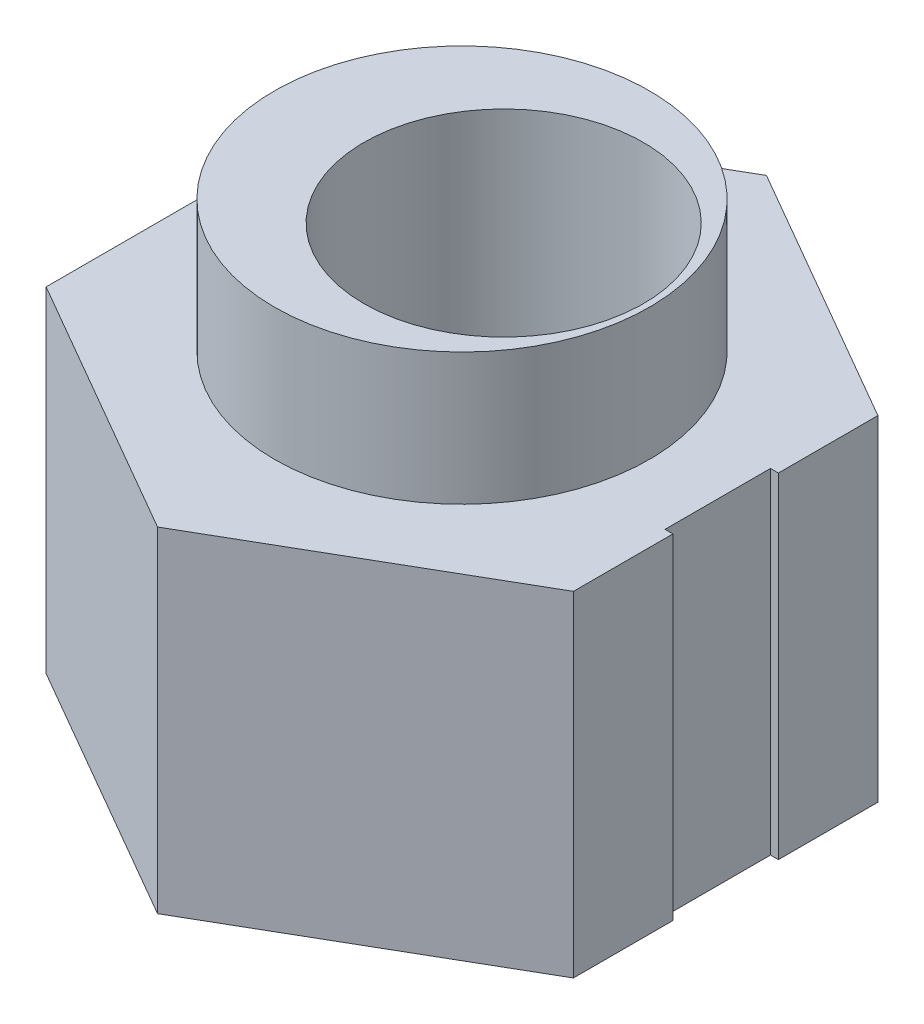
ISO-10303-21;
HEADER;
FILE_DESCRIPTION(('STEP AP214'),'2;1');
FILE_NAME('part.step','',(''),(''),'','','');
FILE_SCHEMA(('AUTOMOTIVE_DESIGN { 1 0 10303 214 1 1 1 1 }'));
ENDSEC;
DATA;
#1=APPLICATION_CONTEXT('core data for automotive mechanical design processes');
#2=APPLICATION_PROTOCOL_DEFINITION('international standard','automotive_design',2000,#1);
#3=PRODUCT_CONTEXT('',#1,'mechanical');
#4=PRODUCT('Part','Part','',(#3));
#5=PRODUCT_RELATED_PRODUCT_CATEGORY('part','',(#4));
#6=PRODUCT_DEFINITION_FORMATION('','',#4);
#7=PRODUCT_DEFINITION_CONTEXT('part definition',#1,'design');
#8=PRODUCT_DEFINITION('design','',#6,#7);
#9=PRODUCT_DEFINITION_SHAPE('','',#8);
#10=(LENGTH_UNIT() NAMED_UNIT(*) SI_UNIT(.MILLI.,.METRE.));
#11=(NAMED_UNIT(*) PLANE_ANGLE_UNIT() SI_UNIT($,.RADIAN.));
#12=(NAMED_UNIT(*) SI_UNIT($,.STERADIAN.) SOLID_ANGLE_UNIT());
#13=UNCERTAINTY_MEASURE_WITH_UNIT(LENGTH_MEASURE(1.E-05),#10,'distance_accuracy_value','');
#14=(GEOMETRIC_REPRESENTATION_CONTEXT(3) GLOBAL_UNCERTAINTY_ASSIGNED_CONTEXT((#13)) GLOBAL_UNIT_ASSIGNED_CONTEXT((#10,
#11,#12)) REPRESENTATION_CONTEXT('',''));
#15=CARTESIAN_POINT('',(0.,0.,0.));
#16=DIRECTION('',(0.,0.,1.));
#17=DIRECTION('',(1.,0.,0.));
#18=AXIS2_PLACEMENT_3D('',#15,#16,#17);
#19=CARTESIAN_POINT('',(0.,6.35,0.));
#20=DIRECTION('',(0.,1.,0.));
#21=DIRECTION('',(0.,0.,1.));
#22=AXIS2_PLACEMENT_3D('',#19,#20,#21);
#23=PLANE('',#22);
#24=DIRECTION('',(0.,0.,-1.));
#25=VECTOR('',#24,1.);
#26=CARTESIAN_POINT('',(4.06,6.35,0.));
#27=LINE('',#26,#25);
#28=CARTESIAN_POINT('',(4.06,6.35,1.));
#29=VERTEX_POINT('',#28);
#30=CARTESIAN_POINT('',(4.06,6.35,-1.));
#31=VERTEX_POINT('',#30);
#32=EDGE_CURVE('E147',#29,#31,#27,.T.);
#33=ORIENTED_EDGE('',*,*,#32,.T.);
#34=DIRECTION('',(1.,0.,0.));
#35=VECTOR('',#34,1.);
#36=CARTESIAN_POINT('',(0.,6.35,-1.));
#37=LINE('',#36,#35);
#38=CARTESIAN_POINT('',(4.21,6.35,-1.));
#39=VERTEX_POINT('',#38);
#40=EDGE_CURVE('E94',#31,#39,#37,.T.);
#41=ORIENTED_EDGE('',*,*,#40,.T.);
#42=DIRECTION('',(0.,0.,-1.));
#43=VECTOR('',#42,1.);
#44=CARTESIAN_POINT('',(4.21,6.35,0.));
#45=LINE('',#44,#43);
#46=CARTESIAN_POINT('',(4.21,6.35,-2.88675134594813));
#47=VERTEX_POINT('',#46);
#48=EDGE_CURVE('E139',#39,#47,#45,.T.);
#49=ORIENTED_EDGE('',*,*,#48,.T.);
#50=DIRECTION('',(-0.866025403784439,0.,-0.5));
#51=VECTOR('',#50,1.);
#52=CARTESIAN_POINT('',(2.3025,6.35,-3.98804698442734));
#53=LINE('',#52,#51);
#54=CARTESIAN_POINT('',(-0.789999999999999,6.35,-5.77350269189626));
#55=VERTEX_POINT('',#54);
#56=EDGE_CURVE('E143',#47,#55,#53,.T.);
#57=ORIENTED_EDGE('',*,*,#56,.T.);
#58=DIRECTION('',(-0.866025403784439,0.,0.5));
#59=VECTOR('',#58,1.);
#60=CARTESIAN_POINT('',(-2.6975,6.35,-4.67220705341705));
#61=LINE('',#60,#59);
#62=CARTESIAN_POINT('',(-5.79,6.35,-2.88675134594813));
#63=VERTEX_POINT('',#62);
#64=EDGE_CURVE('E146',#55,#63,#61,.T.);
#65=ORIENTED_EDGE('',*,*,#64,.T.);
#66=DIRECTION('',(0.,0.,1.));
#67=VECTOR('',#66,1.);
#68=CARTESIAN_POINT('',(-5.79,6.35,0.));
#69=LINE('',#68,#67);
#70=CARTESIAN_POINT('',(-5.79,6.35,2.88675134594813));
#71=VERTEX_POINT('',#70);
#72=EDGE_CURVE('E256',#63,#71,#69,.T.);
#73=ORIENTED_EDGE('',*,*,#72,.T.);
#74=DIRECTION('',(0.866025403784439,0.,0.5));
#75=VECTOR('',#74,1.);
#76=CARTESIAN_POINT('',(-2.6975,6.35,4.67220705341705));
#77=LINE('',#76,#75);
#78=CARTESIAN_POINT('',(-0.79,6.35,5.77350269189626));
#79=VERTEX_POINT('',#78);
#80=EDGE_CURVE('E122',#71,#79,#77,.T.);
#81=ORIENTED_EDGE('',*,*,#80,.T.);
#82=DIRECTION('',(0.866025403784439,0.,-0.5));
#83=VECTOR('',#82,1.);
#84=CARTESIAN_POINT('',(2.3025,6.35,3.98804698442734));
#85=LINE('',#84,#83);
#86=CARTESIAN_POINT('',(4.21,6.35,2.88675134594813));
#87=VERTEX_POINT('',#86);
#88=EDGE_CURVE('E115',#79,#87,#85,.T.);
#89=ORIENTED_EDGE('',*,*,#88,.T.);
#90=CARTESIAN_POINT('',(4.21,6.35,1.));
#91=VERTEX_POINT('',#90);
#92=EDGE_CURVE('E120',#87,#91,#45,.T.);
#93=ORIENTED_EDGE('',*,*,#92,.T.);
#94=DIRECTION('',(1.,0.,0.));
#95=VECTOR('',#94,1.);
#96=CARTESIAN_POINT('',(0.,6.35,1.));
#97=LINE('',#96,#95);
#98=EDGE_CURVE('E137',#29,#91,#97,.T.);
#99=ORIENTED_EDGE('',*,*,#98,.F.);
#100=EDGE_LOOP('',(#33,#41,#49,#57,#65,#73,#81,#89,#93,#99));
#101=FACE_BOUND('',#100,.T.);
#102=CARTESIAN_POINT('',(-0.79,6.35,0.));
#103=DIRECTION('',(0.,1.,0.));
#104=DIRECTION('',(0.,0.,1.));
#105=AXIS2_PLACEMENT_3D('',#102,#103,#104);
#106=CIRCLE('',#105,3.555);
#107=CARTESIAN_POINT('',(-0.79,6.35,3.555));
#108=VERTEX_POINT('',#107);
#109=EDGE_CURVE('E151',#108,#108,#106,.T.);
#110=ORIENTED_EDGE('',*,*,#109,.F.);
#111=EDGE_LOOP('',(#110));
#112=FACE_BOUND('',#111,.T.);
#113=ADVANCED_FACE('F32',(#101,#112),#23,.T.);
#114=CARTESIAN_POINT('',(4.06,6.35,0.));
#115=DIRECTION('',(-1.,0.,0.));
#116=DIRECTION('',(0.,0.,1.));
#117=AXIS2_PLACEMENT_3D('',#114,#115,#116);
#118=PLANE('',#117);
#119=DIRECTION('',(0.,0.,-1.));
#120=VECTOR('',#119,1.);
#121=CARTESIAN_POINT('',(4.06,0.,0.));
#122=LINE('',#121,#120);
#123=CARTESIAN_POINT('',(4.06,0.,1.));
#124=VERTEX_POINT('',#123);
#125=CARTESIAN_POINT('',(4.06,0.,-1.));
#126=VERTEX_POINT('',#125);
#127=EDGE_CURVE('E220',#124,#126,#122,.T.);
#128=ORIENTED_EDGE('',*,*,#127,.T.);
#129=DIRECTION('',(0.,-1.,0.));
#130=VECTOR('',#129,1.);
#131=CARTESIAN_POINT('',(4.06,6.35,-1.));
#132=LINE('',#131,#130);
#133=EDGE_CURVE('E11',#31,#126,#132,.T.);
#134=ORIENTED_EDGE('',*,*,#133,.F.);
#135=ORIENTED_EDGE('',*,*,#32,.F.);
#136=DIRECTION('',(0.,-1.,0.));
#137=VECTOR('',#136,1.);
#138=CARTESIAN_POINT('',(4.06,6.35,1.));
#139=LINE('',#138,#137);
#140=EDGE_CURVE('E49',#29,#124,#139,.T.);
#141=ORIENTED_EDGE('',*,*,#140,.T.);
#142=EDGE_LOOP('',(#128,#134,#135,#141));
#143=FACE_BOUND('',#142,.T.);
#144=ADVANCED_FACE('F179',(#143),#118,.F.);
#145=CARTESIAN_POINT('',(0.,6.35,-1.));
#146=DIRECTION('',(0.,0.,-1.));
#147=DIRECTION('',(-1.,0.,0.));
#148=AXIS2_PLACEMENT_3D('',#145,#146,#147);
#149=PLANE('',#148);
#150=DIRECTION('',(1.,0.,0.));
#151=VECTOR('',#150,1.);
#152=CARTESIAN_POINT('',(0.,0.,-1.));
#153=LINE('',#152,#151);
#154=CARTESIAN_POINT('',(4.21,0.,-1.));
#155=VERTEX_POINT('',#154);
#156=EDGE_CURVE('E214',#126,#155,#153,.T.);
#157=ORIENTED_EDGE('',*,*,#156,.T.);
#158=DIRECTION('',(0.,-1.,0.));
#159=VECTOR('',#158,1.);
#160=CARTESIAN_POINT('',(4.21,6.35,-1.));
#161=LINE('',#160,#159);
#162=EDGE_CURVE('E41',#39,#155,#161,.T.);
#163=ORIENTED_EDGE('',*,*,#162,.F.);
#164=ORIENTED_EDGE('',*,*,#40,.F.);
#165=ORIENTED_EDGE('',*,*,#133,.T.);
#166=EDGE_LOOP('',(#157,#163,#164,#165));
#167=FACE_BOUND('',#166,.T.);
#168=ADVANCED_FACE('F184',(#167),#149,.F.);
#169=CARTESIAN_POINT('',(4.21,6.35,0.));
#170=DIRECTION('',(-1.,0.,0.));
#171=DIRECTION('',(0.,0.,1.));
#172=AXIS2_PLACEMENT_3D('',#169,#170,#171);
#173=PLANE('',#172);
#174=DIRECTION('',(0.,0.,-1.));
#175=VECTOR('',#174,1.);
#176=CARTESIAN_POINT('',(4.21,0.,0.));
#177=LINE('',#176,#175);
#178=CARTESIAN_POINT('',(4.21,0.,-2.88675134594813));
#179=VERTEX_POINT('',#178);
#180=EDGE_CURVE('E219',#155,#179,#177,.T.);
#181=ORIENTED_EDGE('',*,*,#180,.T.);
#182=DIRECTION('',(0.,-1.,0.));
#183=VECTOR('',#182,1.);
#184=CARTESIAN_POINT('',(4.21,6.35,-2.88675134594813));
#185=LINE('',#184,#183);
#186=EDGE_CURVE('E223',#47,#179,#185,.T.);
#187=ORIENTED_EDGE('',*,*,#186,.F.);
#188=ORIENTED_EDGE('',*,*,#48,.F.);
#189=ORIENTED_EDGE('',*,*,#162,.T.);
#190=EDGE_LOOP('',(#181,#187,#188,#189));
#191=FACE_BOUND('',#190,.T.);
#192=ADVANCED_FACE('F190',(#191),#173,.F.);
#193=CARTESIAN_POINT('',(2.3025,6.35,-3.98804698442734));
#194=DIRECTION('',(-0.5,0.,0.866025403784439));
#195=DIRECTION('',(0.866025403784439,0.,0.5));
#196=AXIS2_PLACEMENT_3D('',#193,#194,#195);
#197=PLANE('',#196);
#198=DIRECTION('',(-0.866025403784439,0.,-0.5));
#199=VECTOR('',#198,1.);
#200=CARTESIAN_POINT('',(2.3025,0.,-3.98804698442734));
#201=LINE('',#200,#199);
#202=CARTESIAN_POINT('',(-0.789999999999999,0.,-5.77350269189626));
#203=VERTEX_POINT('',#202);
#204=EDGE_CURVE('E226',#179,#203,#201,.T.);
#205=ORIENTED_EDGE('',*,*,#204,.T.);
#206=DIRECTION('',(0.,-1.,0.));
#207=VECTOR('',#206,1.);
#208=CARTESIAN_POINT('',(-0.789999999999999,6.35,-5.77350269189626));
#209=LINE('',#208,#207);
#210=EDGE_CURVE('E248',#55,#203,#209,.T.);
#211=ORIENTED_EDGE('',*,*,#210,.F.);
#212=ORIENTED_EDGE('',*,*,#56,.F.);
#213=ORIENTED_EDGE('',*,*,#186,.T.);
#214=EDGE_LOOP('',(#205,#211,#212,#213));
#215=FACE_BOUND('',#214,.T.);
#216=ADVANCED_FACE('F204',(#215),#197,.F.);
#217=CARTESIAN_POINT('',(-2.6975,6.35,-4.67220705341705));
#218=DIRECTION('',(0.5,0.,0.866025403784439));
#219=DIRECTION('',(0.866025403784439,0.,-0.5));
#220=AXIS2_PLACEMENT_3D('',#217,#218,#219);
#221=PLANE('',#220);
#222=DIRECTION('',(-0.866025403784439,0.,0.5));
#223=VECTOR('',#222,1.);
#224=CARTESIAN_POINT('',(-2.6975,0.,-4.67220705341705));
#225=LINE('',#224,#223);
#226=CARTESIAN_POINT('',(-5.79,0.,-2.88675134594813));
#227=VERTEX_POINT('',#226);
#228=EDGE_CURVE('E229',#203,#227,#225,.T.);
#229=ORIENTED_EDGE('',*,*,#228,.T.);
#230=DIRECTION('',(0.,-1.,0.));
#231=VECTOR('',#230,1.);
#232=CARTESIAN_POINT('',(-5.79,6.35,-2.88675134594813));
#233=LINE('',#232,#231);
#234=EDGE_CURVE('E245',#63,#227,#233,.T.);
#235=ORIENTED_EDGE('',*,*,#234,.F.);
#236=ORIENTED_EDGE('',*,*,#64,.F.);
#237=ORIENTED_EDGE('',*,*,#210,.T.);
#238=EDGE_LOOP('',(#229,#235,#236,#237));
#239=FACE_BOUND('',#238,.T.);
#240=ADVANCED_FACE('F200',(#239),#221,.F.);
#241=CARTESIAN_POINT('',(-5.79,6.35,0.));
#242=DIRECTION('',(1.,0.,0.));
#243=DIRECTION('',(0.,0.,-1.));
#244=AXIS2_PLACEMENT_3D('',#241,#242,#243);
#245=PLANE('',#244);
#246=DIRECTION('',(0.,0.,1.));
#247=VECTOR('',#246,1.);
#248=CARTESIAN_POINT('',(-5.79,0.,0.));
#249=LINE('',#248,#247);
#250=CARTESIAN_POINT('',(-5.79,0.,2.88675134594813));
#251=VERTEX_POINT('',#250);
#252=EDGE_CURVE('E235',#227,#251,#249,.T.);
#253=ORIENTED_EDGE('',*,*,#252,.T.);
#254=DIRECTION('',(0.,-1.,0.));
#255=VECTOR('',#254,1.);
#256=CARTESIAN_POINT('',(-5.79,6.35,2.88675134594813));
#257=LINE('',#256,#255);
#258=EDGE_CURVE('E242',#71,#251,#257,.T.);
#259=ORIENTED_EDGE('',*,*,#258,.F.);
#260=ORIENTED_EDGE('',*,*,#72,.F.);
#261=ORIENTED_EDGE('',*,*,#234,.T.);
#262=EDGE_LOOP('',(#253,#259,#260,#261));
#263=FACE_BOUND('',#262,.T.);
#264=ADVANCED_FACE('F196',(#263),#245,.F.);
#265=CARTESIAN_POINT('',(-2.6975,6.35,4.67220705341705));
#266=DIRECTION('',(0.5,0.,-0.866025403784439));
#267=DIRECTION('',(-0.866025403784439,0.,-0.5));
#268=AXIS2_PLACEMENT_3D('',#265,#266,#267);
#269=PLANE('',#268);
#270=DIRECTION('',(0.866025403784439,0.,0.5));
#271=VECTOR('',#270,1.);
#272=CARTESIAN_POINT('',(-2.6975,0.,4.67220705341705));
#273=LINE('',#272,#271);
#274=CARTESIAN_POINT('',(-0.79,0.,5.77350269189626));
#275=VERTEX_POINT('',#274);
#276=EDGE_CURVE('E233',#251,#275,#273,.T.);
#277=ORIENTED_EDGE('',*,*,#276,.T.);
#278=DIRECTION('',(0.,-1.,0.));
#279=VECTOR('',#278,1.);
#280=CARTESIAN_POINT('',(-0.79,6.35,5.77350269189626));
#281=LINE('',#280,#279);
#282=EDGE_CURVE('E134',#79,#275,#281,.T.);
#283=ORIENTED_EDGE('',*,*,#282,.F.);
#284=ORIENTED_EDGE('',*,*,#80,.F.);
#285=ORIENTED_EDGE('',*,*,#258,.T.);
#286=EDGE_LOOP('',(#277,#283,#284,#285));
#287=FACE_BOUND('',#286,.T.);
#288=ADVANCED_FACE('F193',(#287),#269,.F.);
#289=CARTESIAN_POINT('',(2.3025,6.35,3.98804698442734));
#290=DIRECTION('',(-0.5,0.,-0.866025403784439));
#291=DIRECTION('',(-0.866025403784439,0.,0.5));
#292=AXIS2_PLACEMENT_3D('',#289,#290,#291);
#293=PLANE('',#292);
#294=DIRECTION('',(0.866025403784439,0.,-0.5));
#295=VECTOR('',#294,1.);
#296=CARTESIAN_POINT('',(2.3025,0.,3.98804698442734));
#297=LINE('',#296,#295);
#298=CARTESIAN_POINT('',(4.21,0.,2.88675134594813));
#299=VERTEX_POINT('',#298);
#300=EDGE_CURVE('E131',#275,#299,#297,.T.);
#301=ORIENTED_EDGE('',*,*,#300,.T.);
#302=DIRECTION('',(0.,-1.,0.));
#303=VECTOR('',#302,1.);
#304=CARTESIAN_POINT('',(4.21,6.35,2.88675134594813));
#305=LINE('',#304,#303);
#306=EDGE_CURVE('E128',#87,#299,#305,.T.);
#307=ORIENTED_EDGE('',*,*,#306,.F.);
#308=ORIENTED_EDGE('',*,*,#88,.F.);
#309=ORIENTED_EDGE('',*,*,#282,.T.);
#310=EDGE_LOOP('',(#301,#307,#308,#309));
#311=FACE_BOUND('',#310,.T.);
#312=ADVANCED_FACE('F129',(#311),#293,.F.);
#313=CARTESIAN_POINT('',(4.21,0.,1.));
#314=VERTEX_POINT('',#313);
#315=EDGE_CURVE('E228',#299,#314,#177,.T.);
#316=ORIENTED_EDGE('',*,*,#315,.T.);
#317=DIRECTION('',(0.,-1.,0.));
#318=VECTOR('',#317,1.);
#319=CARTESIAN_POINT('',(4.21,6.35,1.));
#320=LINE('',#319,#318);
#321=EDGE_CURVE('E82',#91,#314,#320,.T.);
#322=ORIENTED_EDGE('',*,*,#321,.F.);
#323=ORIENTED_EDGE('',*,*,#92,.F.);
#324=ORIENTED_EDGE('',*,*,#306,.T.);
#325=EDGE_LOOP('',(#316,#322,#323,#324));
#326=FACE_BOUND('',#325,.T.);
#327=ADVANCED_FACE('F136',(#326),#173,.F.);
#328=CARTESIAN_POINT('',(0.,6.35,0.));
#329=DIRECTION('',(0.,-1.,0.));
#330=DIRECTION('',(0.,0.,-1.));
#331=AXIS2_PLACEMENT_3D('',#328,#329,#330);
#332=CYLINDRICAL_SURFACE('',#331,2.65);
#333=CARTESIAN_POINT('',(0.,0.,0.));
#334=DIRECTION('',(0.,1.,0.));
#335=DIRECTION('',(0.,0.,1.));
#336=AXIS2_PLACEMENT_3D('',#333,#334,#335);
#337=CIRCLE('',#336,2.65);
#338=CARTESIAN_POINT('',(0.,0.,2.65));
#339=VERTEX_POINT('',#338);
#340=EDGE_CURVE('E158',#339,#339,#337,.T.);
#341=ORIENTED_EDGE('',*,*,#340,.F.);
#342=EDGE_LOOP('',(#341));
#343=FACE_BOUND('',#342,.T.);
#344=CARTESIAN_POINT('',(0.,8.85,0.));
#345=DIRECTION('',(0.,1.,0.));
#346=DIRECTION('',(0.,0.,1.));
#347=AXIS2_PLACEMENT_3D('',#344,#345,#346);
#348=CIRCLE('',#347,2.65);
#349=CARTESIAN_POINT('',(0.,8.85,2.65));
#350=VERTEX_POINT('',#349);
#351=EDGE_CURVE('E155',#350,#350,#348,.T.);
#352=ORIENTED_EDGE('',*,*,#351,.T.);
#353=EDGE_LOOP('',(#352));
#354=FACE_BOUND('',#353,.T.);
#355=ADVANCED_FACE('F34',(#343,#354),#332,.F.);
#356=CARTESIAN_POINT('',(0.,6.35,1.));
#357=DIRECTION('',(0.,0.,-1.));
#358=DIRECTION('',(-1.,0.,0.));
#359=AXIS2_PLACEMENT_3D('',#356,#357,#358);
#360=PLANE('',#359);
#361=DIRECTION('',(1.,0.,0.));
#362=VECTOR('',#361,1.);
#363=CARTESIAN_POINT('',(0.,0.,1.));
#364=LINE('',#363,#362);
#365=EDGE_CURVE('E148',#124,#314,#364,.T.);
#366=ORIENTED_EDGE('',*,*,#365,.F.);
#367=ORIENTED_EDGE('',*,*,#140,.F.);
#368=ORIENTED_EDGE('',*,*,#98,.T.);
#369=ORIENTED_EDGE('',*,*,#321,.T.);
#370=EDGE_LOOP('',(#366,#367,#368,#369));
#371=FACE_BOUND('',#370,.T.);
#372=ADVANCED_FACE('F175',(#371),#360,.T.);
#373=CARTESIAN_POINT('',(0.,0.,0.));
#374=DIRECTION('',(0.,1.,0.));
#375=DIRECTION('',(0.,0.,1.));
#376=AXIS2_PLACEMENT_3D('',#373,#374,#375);
#377=PLANE('',#376);
#378=ORIENTED_EDGE('',*,*,#340,.T.);
#379=EDGE_LOOP('',(#378));
#380=FACE_BOUND('',#379,.T.);
#381=ORIENTED_EDGE('',*,*,#127,.F.);
#382=ORIENTED_EDGE('',*,*,#365,.T.);
#383=ORIENTED_EDGE('',*,*,#315,.F.);
#384=ORIENTED_EDGE('',*,*,#300,.F.);
#385=ORIENTED_EDGE('',*,*,#276,.F.);
#386=ORIENTED_EDGE('',*,*,#252,.F.);
#387=ORIENTED_EDGE('',*,*,#228,.F.);
#388=ORIENTED_EDGE('',*,*,#204,.F.);
#389=ORIENTED_EDGE('',*,*,#180,.F.);
#390=ORIENTED_EDGE('',*,*,#156,.F.);
#391=EDGE_LOOP('',(#381,#382,#383,#384,#385,#386,#387,#388,#389,#390));
#392=FACE_BOUND('',#391,.T.);
#393=ADVANCED_FACE('F166',(#380,#392),#377,.F.);
#394=CARTESIAN_POINT('',(-0.79,8.85,0.));
#395=DIRECTION('',(0.,1.,0.));
#396=DIRECTION('',(0.,0.,1.));
#397=AXIS2_PLACEMENT_3D('',#394,#395,#396);
#398=PLANE('',#397);
#399=CARTESIAN_POINT('',(-0.79,8.85,0.));
#400=DIRECTION('',(0.,1.,0.));
#401=DIRECTION('',(0.,0.,1.));
#402=AXIS2_PLACEMENT_3D('',#399,#400,#401);
#403=CIRCLE('',#402,3.555);
#404=CARTESIAN_POINT('',(-0.79,8.85,3.555));
#405=VERTEX_POINT('',#404);
#406=EDGE_CURVE('E154',#405,#405,#403,.T.);
#407=ORIENTED_EDGE('',*,*,#406,.T.);
#408=EDGE_LOOP('',(#407));
#409=FACE_BOUND('',#408,.T.);
#410=ORIENTED_EDGE('',*,*,#351,.F.);
#411=EDGE_LOOP('',(#410));
#412=FACE_BOUND('',#411,.T.);
#413=ADVANCED_FACE('F163',(#409,#412),#398,.T.);
#414=CARTESIAN_POINT('',(-0.79,8.85,0.));
#415=DIRECTION('',(0.,-1.,0.));
#416=DIRECTION('',(0.,0.,-1.));
#417=AXIS2_PLACEMENT_3D('',#414,#415,#416);
#418=CYLINDRICAL_SURFACE('',#417,3.555);
#419=ORIENTED_EDGE('',*,*,#406,.F.);
#420=EDGE_LOOP('',(#419));
#421=FACE_BOUND('',#420,.T.);
#422=ORIENTED_EDGE('',*,*,#109,.T.);
#423=EDGE_LOOP('',(#422));
#424=FACE_BOUND('',#423,.T.);
#425=ADVANCED_FACE('F165',(#421,#424),#418,.T.);
#426=CLOSED_SHELL('',(#113,#144,#168,#192,#216,#240,#264,#288,#312,#327,#355,#372,#393,#413,#425));
#427=MANIFOLD_SOLID_BREP('B2',#426);
#428=ADVANCED_BREP_SHAPE_REPRESENTATION('',(#18,#427),#14);
#429=SHAPE_DEFINITION_REPRESENTATION(#9,#428);
ENDSEC;
END-ISO-10303-21;
